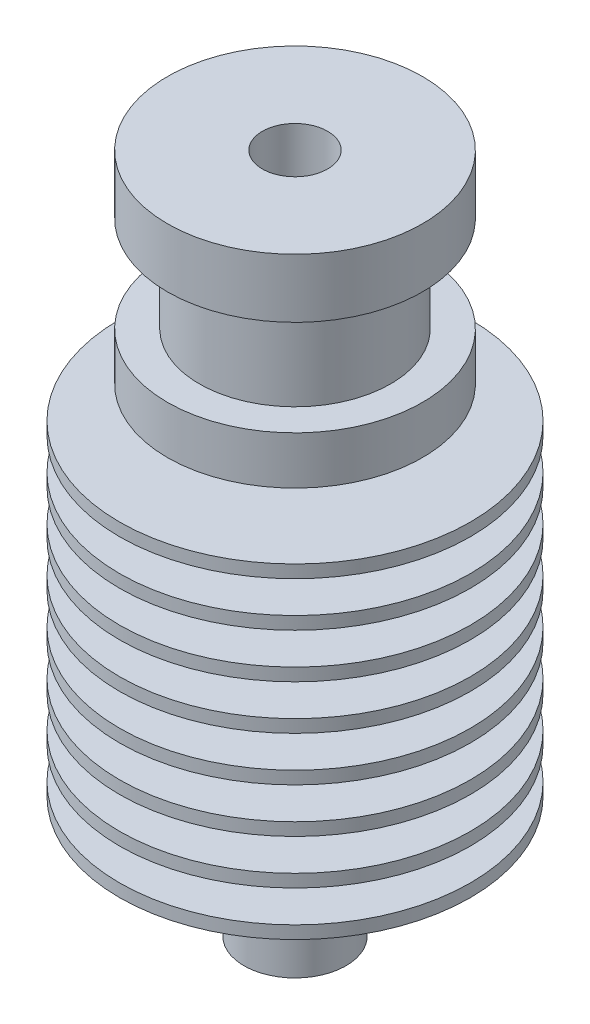
ISO-10303-21;
HEADER;
FILE_DESCRIPTION(('STEP AP214'),'2;1');
FILE_NAME('part.step','',(''),(''),'','','');
FILE_SCHEMA(('AUTOMOTIVE_DESIGN { 1 0 10303 214 1 1 1 1 }'));
ENDSEC;
DATA;
#1=APPLICATION_CONTEXT('core data for automotive mechanical design processes');
#2=APPLICATION_PROTOCOL_DEFINITION('international standard','automotive_design',2000,#1);
#3=PRODUCT_CONTEXT('',#1,'mechanical');
#4=PRODUCT('Part','Part','',(#3));
#5=PRODUCT_RELATED_PRODUCT_CATEGORY('part','',(#4));
#6=PRODUCT_DEFINITION_FORMATION('','',#4);
#7=PRODUCT_DEFINITION_CONTEXT('part definition',#1,'design');
#8=PRODUCT_DEFINITION('design','',#6,#7);
#9=PRODUCT_DEFINITION_SHAPE('','',#8);
#10=(LENGTH_UNIT() NAMED_UNIT(*) SI_UNIT(.MILLI.,.METRE.));
#11=(NAMED_UNIT(*) PLANE_ANGLE_UNIT() SI_UNIT($,.RADIAN.));
#12=(NAMED_UNIT(*) SI_UNIT($,.STERADIAN.) SOLID_ANGLE_UNIT());
#13=UNCERTAINTY_MEASURE_WITH_UNIT(LENGTH_MEASURE(1.E-05),#10,'distance_accuracy_value','');
#14=(GEOMETRIC_REPRESENTATION_CONTEXT(3) GLOBAL_UNCERTAINTY_ASSIGNED_CONTEXT((#13)) GLOBAL_UNIT_ASSIGNED_CONTEXT((#10,
#11,#12)) REPRESENTATION_CONTEXT('',''));
#15=CARTESIAN_POINT('',(0.,0.,0.));
#16=DIRECTION('',(0.,0.,1.));
#17=DIRECTION('',(1.,0.,0.));
#18=AXIS2_PLACEMENT_3D('',#15,#16,#17);
#19=CARTESIAN_POINT('',(6.,11.65,0.));
#20=DIRECTION('',(0.,1.,0.));
#21=DIRECTION('',(0.,0.,1.));
#22=AXIS2_PLACEMENT_3D('',#19,#20,#21);
#23=PLANE('',#22);
#24=CARTESIAN_POINT('',(0.,11.65,0.));
#25=DIRECTION('',(0.,-1.,0.));
#26=DIRECTION('',(0.,0.,-1.));
#27=AXIS2_PLACEMENT_3D('',#24,#25,#26);
#28=CIRCLE('',#27,6.);
#29=CARTESIAN_POINT('',(0.,11.65,-6.));
#30=VERTEX_POINT('',#29);
#31=EDGE_CURVE('E221',#30,#30,#28,.T.);
#32=ORIENTED_EDGE('',*,*,#31,.T.);
#33=EDGE_LOOP('',(#32));
#34=FACE_BOUND('',#33,.T.);
#35=CARTESIAN_POINT('',(0.,11.65,0.));
#36=DIRECTION('',(0.,-1.,0.));
#37=DIRECTION('',(0.,0.,-1.));
#38=AXIS2_PLACEMENT_3D('',#35,#36,#37);
#39=CIRCLE('',#38,7.99999999999999);
#40=CARTESIAN_POINT('',(0.,11.65,-7.99999999999999));
#41=VERTEX_POINT('',#40);
#42=EDGE_CURVE('E10',#41,#41,#39,.T.);
#43=ORIENTED_EDGE('',*,*,#42,.F.);
#44=EDGE_LOOP('',(#43));
#45=FACE_BOUND('',#44,.T.);
#46=ADVANCED_FACE('F40',(#34,#45),#23,.T.);
#47=CARTESIAN_POINT('',(0.,-21.35,0.));
#48=DIRECTION('',(0.,-1.,0.));
#49=DIRECTION('',(0.,0.,-1.));
#50=AXIS2_PLACEMENT_3D('',#47,#48,#49);
#51=CYLINDRICAL_SURFACE('',#50,7.99999999999999);
#52=ORIENTED_EDGE('',*,*,#42,.T.);
#53=EDGE_LOOP('',(#52));
#54=FACE_BOUND('',#53,.T.);
#55=CARTESIAN_POINT('',(0.,8.65,0.));
#56=DIRECTION('',(0.,-1.,0.));
#57=DIRECTION('',(0.,0.,-1.));
#58=AXIS2_PLACEMENT_3D('',#55,#56,#57);
#59=CIRCLE('',#58,7.99999999999999);
#60=CARTESIAN_POINT('',(0.,8.65,-7.99999999999999));
#61=VERTEX_POINT('',#60);
#62=EDGE_CURVE('E47',#61,#61,#59,.T.);
#63=ORIENTED_EDGE('',*,*,#62,.F.);
#64=EDGE_LOOP('',(#63));
#65=FACE_BOUND('',#64,.T.);
#66=ADVANCED_FACE('F239',(#54,#65),#51,.T.);
#67=CARTESIAN_POINT('',(7.99999999999999,8.65,0.));
#68=DIRECTION('',(0.,-1.,0.));
#69=DIRECTION('',(0.,0.,-1.));
#70=AXIS2_PLACEMENT_3D('',#67,#68,#69);
#71=PLANE('',#70);
#72=ORIENTED_EDGE('',*,*,#62,.T.);
#73=EDGE_LOOP('',(#72));
#74=FACE_BOUND('',#73,.T.);
#75=CARTESIAN_POINT('',(0.,8.65000000000001,0.));
#76=DIRECTION('',(0.,-1.,0.));
#77=DIRECTION('',(0.,0.,-1.));
#78=AXIS2_PLACEMENT_3D('',#75,#76,#77);
#79=CIRCLE('',#78,3.);
#80=CARTESIAN_POINT('',(0.,8.65000000000001,-3.));
#81=VERTEX_POINT('',#80);
#82=EDGE_CURVE('E54',#81,#81,#79,.T.);
#83=ORIENTED_EDGE('',*,*,#82,.F.);
#84=EDGE_LOOP('',(#83));
#85=FACE_BOUND('',#84,.T.);
#86=ADVANCED_FACE('F243',(#74,#85),#71,.T.);
#87=CARTESIAN_POINT('',(0.,-21.35,0.));
#88=DIRECTION('',(0.,-1.,0.));
#89=DIRECTION('',(0.,0.,-1.));
#90=AXIS2_PLACEMENT_3D('',#87,#88,#89);
#91=CYLINDRICAL_SURFACE('',#90,3.);
#92=ORIENTED_EDGE('',*,*,#82,.T.);
#93=EDGE_LOOP('',(#92));
#94=FACE_BOUND('',#93,.T.);
#95=CARTESIAN_POINT('',(0.,6.65,0.));
#96=DIRECTION('',(0.,-1.,0.));
#97=DIRECTION('',(0.,0.,-1.));
#98=AXIS2_PLACEMENT_3D('',#95,#96,#97);
#99=CIRCLE('',#98,3.);
#100=CARTESIAN_POINT('',(0.,6.65,-3.));
#101=VERTEX_POINT('',#100);
#102=EDGE_CURVE('E61',#101,#101,#99,.T.);
#103=ORIENTED_EDGE('',*,*,#102,.F.);
#104=EDGE_LOOP('',(#103));
#105=FACE_BOUND('',#104,.T.);
#106=ADVANCED_FACE('F247',(#94,#105),#91,.T.);
#107=CARTESIAN_POINT('',(3.,6.65,0.));
#108=DIRECTION('',(0.,1.,0.));
#109=DIRECTION('',(0.,0.,1.));
#110=AXIS2_PLACEMENT_3D('',#107,#108,#109);
#111=PLANE('',#110);
#112=ORIENTED_EDGE('',*,*,#102,.T.);
#113=EDGE_LOOP('',(#112));
#114=FACE_BOUND('',#113,.T.);
#115=CARTESIAN_POINT('',(0.,6.65,0.));
#116=DIRECTION('',(0.,-1.,0.));
#117=DIRECTION('',(0.,0.,-1.));
#118=AXIS2_PLACEMENT_3D('',#115,#116,#117);
#119=CIRCLE('',#118,11.);
#120=CARTESIAN_POINT('',(0.,6.65,-11.));
#121=VERTEX_POINT('',#120);
#122=EDGE_CURVE('E67',#121,#121,#119,.T.);
#123=ORIENTED_EDGE('',*,*,#122,.F.);
#124=EDGE_LOOP('',(#123));
#125=FACE_BOUND('',#124,.T.);
#126=ADVANCED_FACE('F253',(#114,#125),#111,.T.);
#127=CARTESIAN_POINT('',(0.,-21.35,0.));
#128=DIRECTION('',(0.,-1.,0.));
#129=DIRECTION('',(0.,0.,-1.));
#130=AXIS2_PLACEMENT_3D('',#127,#128,#129);
#131=CYLINDRICAL_SURFACE('',#130,11.);
#132=ORIENTED_EDGE('',*,*,#122,.T.);
#133=EDGE_LOOP('',(#132));
#134=FACE_BOUND('',#133,.T.);
#135=CARTESIAN_POINT('',(0.,5.85,0.));
#136=DIRECTION('',(0.,-1.,0.));
#137=DIRECTION('',(0.,0.,-1.));
#138=AXIS2_PLACEMENT_3D('',#135,#136,#137);
#139=CIRCLE('',#138,11.);
#140=CARTESIAN_POINT('',(0.,5.85,-11.));
#141=VERTEX_POINT('',#140);
#142=EDGE_CURVE('E71',#141,#141,#139,.T.);
#143=ORIENTED_EDGE('',*,*,#142,.F.);
#144=EDGE_LOOP('',(#143));
#145=FACE_BOUND('',#144,.T.);
#146=ADVANCED_FACE('F257',(#134,#145),#131,.T.);
#147=CARTESIAN_POINT('',(11.,5.85,0.));
#148=DIRECTION('',(0.,-1.,0.));
#149=DIRECTION('',(0.,0.,-1.));
#150=AXIS2_PLACEMENT_3D('',#147,#148,#149);
#151=PLANE('',#150);
#152=ORIENTED_EDGE('',*,*,#142,.T.);
#153=EDGE_LOOP('',(#152));
#154=FACE_BOUND('',#153,.T.);
#155=CARTESIAN_POINT('',(0.,5.85,0.));
#156=DIRECTION('',(0.,-1.,0.));
#157=DIRECTION('',(0.,0.,-1.));
#158=AXIS2_PLACEMENT_3D('',#155,#156,#157);
#159=CIRCLE('',#158,3.);
#160=CARTESIAN_POINT('',(0.,5.85,-3.));
#161=VERTEX_POINT('',#160);
#162=EDGE_CURVE('E75',#161,#161,#159,.T.);
#163=ORIENTED_EDGE('',*,*,#162,.F.);
#164=EDGE_LOOP('',(#163));
#165=FACE_BOUND('',#164,.T.);
#166=ADVANCED_FACE('F261',(#154,#165),#151,.T.);
#167=CARTESIAN_POINT('',(0.,-21.35,0.));
#168=DIRECTION('',(0.,-1.,0.));
#169=DIRECTION('',(0.,0.,-1.));
#170=AXIS2_PLACEMENT_3D('',#167,#168,#169);
#171=CYLINDRICAL_SURFACE('',#170,3.);
#172=ORIENTED_EDGE('',*,*,#162,.T.);
#173=EDGE_LOOP('',(#172));
#174=FACE_BOUND('',#173,.T.);
#175=CARTESIAN_POINT('',(0.,3.85,0.));
#176=DIRECTION('',(0.,-1.,0.));
#177=DIRECTION('',(0.,0.,-1.));
#178=AXIS2_PLACEMENT_3D('',#175,#176,#177);
#179=CIRCLE('',#178,3.);
#180=CARTESIAN_POINT('',(0.,3.85,-3.));
#181=VERTEX_POINT('',#180);
#182=EDGE_CURVE('E79',#181,#181,#179,.T.);
#183=ORIENTED_EDGE('',*,*,#182,.F.);
#184=EDGE_LOOP('',(#183));
#185=FACE_BOUND('',#184,.T.);
#186=ADVANCED_FACE('F265',(#174,#185),#171,.T.);
#187=CARTESIAN_POINT('',(3.,3.85,0.));
#188=DIRECTION('',(0.,1.,0.));
#189=DIRECTION('',(0.,0.,1.));
#190=AXIS2_PLACEMENT_3D('',#187,#188,#189);
#191=PLANE('',#190);
#192=ORIENTED_EDGE('',*,*,#182,.T.);
#193=EDGE_LOOP('',(#192));
#194=FACE_BOUND('',#193,.T.);
#195=CARTESIAN_POINT('',(0.,3.85,0.));
#196=DIRECTION('',(0.,-1.,0.));
#197=DIRECTION('',(0.,0.,-1.));
#198=AXIS2_PLACEMENT_3D('',#195,#196,#197);
#199=CIRCLE('',#198,11.);
#200=CARTESIAN_POINT('',(0.,3.85,-11.));
#201=VERTEX_POINT('',#200);
#202=EDGE_CURVE('E83',#201,#201,#199,.T.);
#203=ORIENTED_EDGE('',*,*,#202,.F.);
#204=EDGE_LOOP('',(#203));
#205=FACE_BOUND('',#204,.T.);
#206=ADVANCED_FACE('F269',(#194,#205),#191,.T.);
#207=CARTESIAN_POINT('',(0.,-21.35,0.));
#208=DIRECTION('',(0.,-1.,0.));
#209=DIRECTION('',(0.,0.,-1.));
#210=AXIS2_PLACEMENT_3D('',#207,#208,#209);
#211=CYLINDRICAL_SURFACE('',#210,11.);
#212=ORIENTED_EDGE('',*,*,#202,.T.);
#213=EDGE_LOOP('',(#212));
#214=FACE_BOUND('',#213,.T.);
#215=CARTESIAN_POINT('',(0.,3.05,0.));
#216=DIRECTION('',(0.,-1.,0.));
#217=DIRECTION('',(0.,0.,-1.));
#218=AXIS2_PLACEMENT_3D('',#215,#216,#217);
#219=CIRCLE('',#218,11.);
#220=CARTESIAN_POINT('',(0.,3.05,-11.));
#221=VERTEX_POINT('',#220);
#222=EDGE_CURVE('E87',#221,#221,#219,.T.);
#223=ORIENTED_EDGE('',*,*,#222,.F.);
#224=EDGE_LOOP('',(#223));
#225=FACE_BOUND('',#224,.T.);
#226=ADVANCED_FACE('F273',(#214,#225),#211,.T.);
#227=CARTESIAN_POINT('',(11.,3.05,0.));
#228=DIRECTION('',(0.,-1.,0.));
#229=DIRECTION('',(0.,0.,-1.));
#230=AXIS2_PLACEMENT_3D('',#227,#228,#229);
#231=PLANE('',#230);
#232=ORIENTED_EDGE('',*,*,#222,.T.);
#233=EDGE_LOOP('',(#232));
#234=FACE_BOUND('',#233,.T.);
#235=CARTESIAN_POINT('',(0.,3.05,0.));
#236=DIRECTION('',(0.,-1.,0.));
#237=DIRECTION('',(0.,0.,-1.));
#238=AXIS2_PLACEMENT_3D('',#235,#236,#237);
#239=CIRCLE('',#238,3.);
#240=CARTESIAN_POINT('',(0.,3.05,-3.));
#241=VERTEX_POINT('',#240);
#242=EDGE_CURVE('E91',#241,#241,#239,.T.);
#243=ORIENTED_EDGE('',*,*,#242,.F.);
#244=EDGE_LOOP('',(#243));
#245=FACE_BOUND('',#244,.T.);
#246=ADVANCED_FACE('F277',(#234,#245),#231,.T.);
#247=CARTESIAN_POINT('',(0.,-21.35,0.));
#248=DIRECTION('',(0.,-1.,0.));
#249=DIRECTION('',(0.,0.,-1.));
#250=AXIS2_PLACEMENT_3D('',#247,#248,#249);
#251=CYLINDRICAL_SURFACE('',#250,3.);
#252=ORIENTED_EDGE('',*,*,#242,.T.);
#253=EDGE_LOOP('',(#252));
#254=FACE_BOUND('',#253,.T.);
#255=CARTESIAN_POINT('',(0.,1.05,0.));
#256=DIRECTION('',(0.,-1.,0.));
#257=DIRECTION('',(0.,0.,-1.));
#258=AXIS2_PLACEMENT_3D('',#255,#256,#257);
#259=CIRCLE('',#258,3.);
#260=CARTESIAN_POINT('',(0.,1.05,-3.));
#261=VERTEX_POINT('',#260);
#262=EDGE_CURVE('E95',#261,#261,#259,.T.);
#263=ORIENTED_EDGE('',*,*,#262,.F.);
#264=EDGE_LOOP('',(#263));
#265=FACE_BOUND('',#264,.T.);
#266=ADVANCED_FACE('F281',(#254,#265),#251,.T.);
#267=CARTESIAN_POINT('',(3.,1.05,0.));
#268=DIRECTION('',(0.,1.,0.));
#269=DIRECTION('',(0.,0.,1.));
#270=AXIS2_PLACEMENT_3D('',#267,#268,#269);
#271=PLANE('',#270);
#272=ORIENTED_EDGE('',*,*,#262,.T.);
#273=EDGE_LOOP('',(#272));
#274=FACE_BOUND('',#273,.T.);
#275=CARTESIAN_POINT('',(0.,1.05,0.));
#276=DIRECTION('',(0.,-1.,0.));
#277=DIRECTION('',(0.,0.,-1.));
#278=AXIS2_PLACEMENT_3D('',#275,#276,#277);
#279=CIRCLE('',#278,11.);
#280=CARTESIAN_POINT('',(0.,1.05,-11.));
#281=VERTEX_POINT('',#280);
#282=EDGE_CURVE('E99',#281,#281,#279,.T.);
#283=ORIENTED_EDGE('',*,*,#282,.F.);
#284=EDGE_LOOP('',(#283));
#285=FACE_BOUND('',#284,.T.);
#286=ADVANCED_FACE('F285',(#274,#285),#271,.T.);
#287=CARTESIAN_POINT('',(0.,-21.35,0.));
#288=DIRECTION('',(0.,-1.,0.));
#289=DIRECTION('',(0.,0.,-1.));
#290=AXIS2_PLACEMENT_3D('',#287,#288,#289);
#291=CYLINDRICAL_SURFACE('',#290,11.);
#292=ORIENTED_EDGE('',*,*,#282,.T.);
#293=EDGE_LOOP('',(#292));
#294=FACE_BOUND('',#293,.T.);
#295=CARTESIAN_POINT('',(0.,0.25,0.));
#296=DIRECTION('',(0.,-1.,0.));
#297=DIRECTION('',(0.,0.,-1.));
#298=AXIS2_PLACEMENT_3D('',#295,#296,#297);
#299=CIRCLE('',#298,11.);
#300=CARTESIAN_POINT('',(0.,0.25,-11.));
#301=VERTEX_POINT('',#300);
#302=EDGE_CURVE('E103',#301,#301,#299,.T.);
#303=ORIENTED_EDGE('',*,*,#302,.F.);
#304=EDGE_LOOP('',(#303));
#305=FACE_BOUND('',#304,.T.);
#306=ADVANCED_FACE('F289',(#294,#305),#291,.T.);
#307=CARTESIAN_POINT('',(11.,0.249999999999998,0.));
#308=DIRECTION('',(0.,-1.,0.));
#309=DIRECTION('',(0.,0.,-1.));
#310=AXIS2_PLACEMENT_3D('',#307,#308,#309);
#311=PLANE('',#310);
#312=ORIENTED_EDGE('',*,*,#302,.T.);
#313=EDGE_LOOP('',(#312));
#314=FACE_BOUND('',#313,.T.);
#315=CARTESIAN_POINT('',(0.,0.249999999999997,0.));
#316=DIRECTION('',(0.,-1.,0.));
#317=DIRECTION('',(0.,0.,-1.));
#318=AXIS2_PLACEMENT_3D('',#315,#316,#317);
#319=CIRCLE('',#318,3.);
#320=CARTESIAN_POINT('',(0.,0.249999999999997,-3.));
#321=VERTEX_POINT('',#320);
#322=EDGE_CURVE('E107',#321,#321,#319,.T.);
#323=ORIENTED_EDGE('',*,*,#322,.F.);
#324=EDGE_LOOP('',(#323));
#325=FACE_BOUND('',#324,.T.);
#326=ADVANCED_FACE('F293',(#314,#325),#311,.T.);
#327=CARTESIAN_POINT('',(0.,-21.35,0.));
#328=DIRECTION('',(0.,-1.,0.));
#329=DIRECTION('',(0.,0.,-1.));
#330=AXIS2_PLACEMENT_3D('',#327,#328,#329);
#331=CYLINDRICAL_SURFACE('',#330,3.);
#332=ORIENTED_EDGE('',*,*,#322,.T.);
#333=EDGE_LOOP('',(#332));
#334=FACE_BOUND('',#333,.T.);
#335=CARTESIAN_POINT('',(0.,-1.75,0.));
#336=DIRECTION('',(0.,-1.,0.));
#337=DIRECTION('',(0.,0.,-1.));
#338=AXIS2_PLACEMENT_3D('',#335,#336,#337);
#339=CIRCLE('',#338,3.);
#340=CARTESIAN_POINT('',(0.,-1.75,-3.));
#341=VERTEX_POINT('',#340);
#342=EDGE_CURVE('E111',#341,#341,#339,.T.);
#343=ORIENTED_EDGE('',*,*,#342,.F.);
#344=EDGE_LOOP('',(#343));
#345=FACE_BOUND('',#344,.T.);
#346=ADVANCED_FACE('F297',(#334,#345),#331,.T.);
#347=CARTESIAN_POINT('',(3.,-1.75,0.));
#348=DIRECTION('',(0.,1.,0.));
#349=DIRECTION('',(0.,0.,1.));
#350=AXIS2_PLACEMENT_3D('',#347,#348,#349);
#351=PLANE('',#350);
#352=ORIENTED_EDGE('',*,*,#342,.T.);
#353=EDGE_LOOP('',(#352));
#354=FACE_BOUND('',#353,.T.);
#355=CARTESIAN_POINT('',(0.,-1.75,0.));
#356=DIRECTION('',(0.,-1.,0.));
#357=DIRECTION('',(0.,0.,-1.));
#358=AXIS2_PLACEMENT_3D('',#355,#356,#357);
#359=CIRCLE('',#358,11.);
#360=CARTESIAN_POINT('',(0.,-1.75,-11.));
#361=VERTEX_POINT('',#360);
#362=EDGE_CURVE('E115',#361,#361,#359,.T.);
#363=ORIENTED_EDGE('',*,*,#362,.F.);
#364=EDGE_LOOP('',(#363));
#365=FACE_BOUND('',#364,.T.);
#366=ADVANCED_FACE('F301',(#354,#365),#351,.T.);
#367=CARTESIAN_POINT('',(0.,-21.35,0.));
#368=DIRECTION('',(0.,-1.,0.));
#369=DIRECTION('',(0.,0.,-1.));
#370=AXIS2_PLACEMENT_3D('',#367,#368,#369);
#371=CYLINDRICAL_SURFACE('',#370,11.);
#372=ORIENTED_EDGE('',*,*,#362,.T.);
#373=EDGE_LOOP('',(#372));
#374=FACE_BOUND('',#373,.T.);
#375=CARTESIAN_POINT('',(0.,-2.55,0.));
#376=DIRECTION('',(0.,-1.,0.));
#377=DIRECTION('',(0.,0.,-1.));
#378=AXIS2_PLACEMENT_3D('',#375,#376,#377);
#379=CIRCLE('',#378,11.);
#380=CARTESIAN_POINT('',(0.,-2.55,-11.));
#381=VERTEX_POINT('',#380);
#382=EDGE_CURVE('E119',#381,#381,#379,.T.);
#383=ORIENTED_EDGE('',*,*,#382,.F.);
#384=EDGE_LOOP('',(#383));
#385=FACE_BOUND('',#384,.T.);
#386=ADVANCED_FACE('F305',(#374,#385),#371,.T.);
#387=CARTESIAN_POINT('',(11.,-2.55,0.));
#388=DIRECTION('',(0.,-1.,0.));
#389=DIRECTION('',(0.,0.,-1.));
#390=AXIS2_PLACEMENT_3D('',#387,#388,#389);
#391=PLANE('',#390);
#392=ORIENTED_EDGE('',*,*,#382,.T.);
#393=EDGE_LOOP('',(#392));
#394=FACE_BOUND('',#393,.T.);
#395=CARTESIAN_POINT('',(0.,-2.55,0.));
#396=DIRECTION('',(0.,-1.,0.));
#397=DIRECTION('',(0.,0.,-1.));
#398=AXIS2_PLACEMENT_3D('',#395,#396,#397);
#399=CIRCLE('',#398,3.);
#400=CARTESIAN_POINT('',(0.,-2.55,-3.));
#401=VERTEX_POINT('',#400);
#402=EDGE_CURVE('E123',#401,#401,#399,.T.);
#403=ORIENTED_EDGE('',*,*,#402,.F.);
#404=EDGE_LOOP('',(#403));
#405=FACE_BOUND('',#404,.T.);
#406=ADVANCED_FACE('F309',(#394,#405),#391,.T.);
#407=CARTESIAN_POINT('',(0.,-21.35,0.));
#408=DIRECTION('',(0.,-1.,0.));
#409=DIRECTION('',(0.,0.,-1.));
#410=AXIS2_PLACEMENT_3D('',#407,#408,#409);
#411=CYLINDRICAL_SURFACE('',#410,3.);
#412=ORIENTED_EDGE('',*,*,#402,.T.);
#413=EDGE_LOOP('',(#412));
#414=FACE_BOUND('',#413,.T.);
#415=CARTESIAN_POINT('',(0.,-4.55000000000001,0.));
#416=DIRECTION('',(0.,-1.,0.));
#417=DIRECTION('',(0.,0.,-1.));
#418=AXIS2_PLACEMENT_3D('',#415,#416,#417);
#419=CIRCLE('',#418,3.);
#420=CARTESIAN_POINT('',(0.,-4.55000000000001,-3.));
#421=VERTEX_POINT('',#420);
#422=EDGE_CURVE('E127',#421,#421,#419,.T.);
#423=ORIENTED_EDGE('',*,*,#422,.F.);
#424=EDGE_LOOP('',(#423));
#425=FACE_BOUND('',#424,.T.);
#426=ADVANCED_FACE('F313',(#414,#425),#411,.T.);
#427=CARTESIAN_POINT('',(3.,-4.55,0.));
#428=DIRECTION('',(0.,1.,0.));
#429=DIRECTION('',(0.,0.,1.));
#430=AXIS2_PLACEMENT_3D('',#427,#428,#429);
#431=PLANE('',#430);
#432=ORIENTED_EDGE('',*,*,#422,.T.);
#433=EDGE_LOOP('',(#432));
#434=FACE_BOUND('',#433,.T.);
#435=CARTESIAN_POINT('',(0.,-4.55000000000001,0.));
#436=DIRECTION('',(0.,-1.,0.));
#437=DIRECTION('',(0.,0.,-1.));
#438=AXIS2_PLACEMENT_3D('',#435,#436,#437);
#439=CIRCLE('',#438,11.);
#440=CARTESIAN_POINT('',(0.,-4.55000000000001,-11.));
#441=VERTEX_POINT('',#440);
#442=EDGE_CURVE('E131',#441,#441,#439,.T.);
#443=ORIENTED_EDGE('',*,*,#442,.F.);
#444=EDGE_LOOP('',(#443));
#445=FACE_BOUND('',#444,.T.);
#446=ADVANCED_FACE('F317',(#434,#445),#431,.T.);
#447=CARTESIAN_POINT('',(0.,-21.35,0.));
#448=DIRECTION('',(0.,-1.,0.));
#449=DIRECTION('',(0.,0.,-1.));
#450=AXIS2_PLACEMENT_3D('',#447,#448,#449);
#451=CYLINDRICAL_SURFACE('',#450,11.);
#452=ORIENTED_EDGE('',*,*,#442,.T.);
#453=EDGE_LOOP('',(#452));
#454=FACE_BOUND('',#453,.T.);
#455=CARTESIAN_POINT('',(0.,-5.35,0.));
#456=DIRECTION('',(0.,-1.,0.));
#457=DIRECTION('',(0.,0.,-1.));
#458=AXIS2_PLACEMENT_3D('',#455,#456,#457);
#459=CIRCLE('',#458,11.);
#460=CARTESIAN_POINT('',(0.,-5.35,-11.));
#461=VERTEX_POINT('',#460);
#462=EDGE_CURVE('E135',#461,#461,#459,.T.);
#463=ORIENTED_EDGE('',*,*,#462,.F.);
#464=EDGE_LOOP('',(#463));
#465=FACE_BOUND('',#464,.T.);
#466=ADVANCED_FACE('F321',(#454,#465),#451,.T.);
#467=CARTESIAN_POINT('',(11.,-5.35000000000001,0.));
#468=DIRECTION('',(0.,-1.,0.));
#469=DIRECTION('',(0.,0.,-1.));
#470=AXIS2_PLACEMENT_3D('',#467,#468,#469);
#471=PLANE('',#470);
#472=ORIENTED_EDGE('',*,*,#462,.T.);
#473=EDGE_LOOP('',(#472));
#474=FACE_BOUND('',#473,.T.);
#475=CARTESIAN_POINT('',(0.,-5.35000000000001,0.));
#476=DIRECTION('',(0.,-1.,0.));
#477=DIRECTION('',(0.,0.,-1.));
#478=AXIS2_PLACEMENT_3D('',#475,#476,#477);
#479=CIRCLE('',#478,3.);
#480=CARTESIAN_POINT('',(0.,-5.35000000000001,-3.));
#481=VERTEX_POINT('',#480);
#482=EDGE_CURVE('E139',#481,#481,#479,.T.);
#483=ORIENTED_EDGE('',*,*,#482,.F.);
#484=EDGE_LOOP('',(#483));
#485=FACE_BOUND('',#484,.T.);
#486=ADVANCED_FACE('F325',(#474,#485),#471,.T.);
#487=CARTESIAN_POINT('',(0.,-21.35,0.));
#488=DIRECTION('',(0.,-1.,0.));
#489=DIRECTION('',(0.,0.,-1.));
#490=AXIS2_PLACEMENT_3D('',#487,#488,#489);
#491=CYLINDRICAL_SURFACE('',#490,3.);
#492=ORIENTED_EDGE('',*,*,#482,.T.);
#493=EDGE_LOOP('',(#492));
#494=FACE_BOUND('',#493,.T.);
#495=CARTESIAN_POINT('',(0.,-7.35000000000001,0.));
#496=DIRECTION('',(0.,-1.,0.));
#497=DIRECTION('',(0.,0.,-1.));
#498=AXIS2_PLACEMENT_3D('',#495,#496,#497);
#499=CIRCLE('',#498,3.);
#500=CARTESIAN_POINT('',(0.,-7.35000000000001,-3.));
#501=VERTEX_POINT('',#500);
#502=EDGE_CURVE('E143',#501,#501,#499,.T.);
#503=ORIENTED_EDGE('',*,*,#502,.F.);
#504=EDGE_LOOP('',(#503));
#505=FACE_BOUND('',#504,.T.);
#506=ADVANCED_FACE('F329',(#494,#505),#491,.T.);
#507=CARTESIAN_POINT('',(3.,-7.35000000000001,0.));
#508=DIRECTION('',(0.,1.,0.));
#509=DIRECTION('',(0.,0.,1.));
#510=AXIS2_PLACEMENT_3D('',#507,#508,#509);
#511=PLANE('',#510);
#512=ORIENTED_EDGE('',*,*,#502,.T.);
#513=EDGE_LOOP('',(#512));
#514=FACE_BOUND('',#513,.T.);
#515=CARTESIAN_POINT('',(0.,-7.35000000000001,0.));
#516=DIRECTION('',(0.,-1.,0.));
#517=DIRECTION('',(0.,0.,-1.));
#518=AXIS2_PLACEMENT_3D('',#515,#516,#517);
#519=CIRCLE('',#518,11.);
#520=CARTESIAN_POINT('',(0.,-7.35000000000001,-11.));
#521=VERTEX_POINT('',#520);
#522=EDGE_CURVE('E147',#521,#521,#519,.T.);
#523=ORIENTED_EDGE('',*,*,#522,.F.);
#524=EDGE_LOOP('',(#523));
#525=FACE_BOUND('',#524,.T.);
#526=ADVANCED_FACE('F333',(#514,#525),#511,.T.);
#527=CARTESIAN_POINT('',(0.,-21.35,0.));
#528=DIRECTION('',(0.,-1.,0.));
#529=DIRECTION('',(0.,0.,-1.));
#530=AXIS2_PLACEMENT_3D('',#527,#528,#529);
#531=CYLINDRICAL_SURFACE('',#530,11.);
#532=ORIENTED_EDGE('',*,*,#522,.T.);
#533=EDGE_LOOP('',(#532));
#534=FACE_BOUND('',#533,.T.);
#535=CARTESIAN_POINT('',(0.,-8.15000000000001,0.));
#536=DIRECTION('',(0.,-1.,0.));
#537=DIRECTION('',(0.,0.,-1.));
#538=AXIS2_PLACEMENT_3D('',#535,#536,#537);
#539=CIRCLE('',#538,11.);
#540=CARTESIAN_POINT('',(0.,-8.15000000000001,-11.));
#541=VERTEX_POINT('',#540);
#542=EDGE_CURVE('E151',#541,#541,#539,.T.);
#543=ORIENTED_EDGE('',*,*,#542,.F.);
#544=EDGE_LOOP('',(#543));
#545=FACE_BOUND('',#544,.T.);
#546=ADVANCED_FACE('F337',(#534,#545),#531,.T.);
#547=CARTESIAN_POINT('',(11.,-8.15000000000001,0.));
#548=DIRECTION('',(0.,-1.,0.));
#549=DIRECTION('',(0.,0.,-1.));
#550=AXIS2_PLACEMENT_3D('',#547,#548,#549);
#551=PLANE('',#550);
#552=ORIENTED_EDGE('',*,*,#542,.T.);
#553=EDGE_LOOP('',(#552));
#554=FACE_BOUND('',#553,.T.);
#555=CARTESIAN_POINT('',(0.,-8.15000000000001,0.));
#556=DIRECTION('',(0.,-1.,0.));
#557=DIRECTION('',(0.,0.,-1.));
#558=AXIS2_PLACEMENT_3D('',#555,#556,#557);
#559=CIRCLE('',#558,3.);
#560=CARTESIAN_POINT('',(0.,-8.15000000000001,-3.));
#561=VERTEX_POINT('',#560);
#562=EDGE_CURVE('E154',#561,#561,#559,.T.);
#563=ORIENTED_EDGE('',*,*,#562,.F.);
#564=EDGE_LOOP('',(#563));
#565=FACE_BOUND('',#564,.T.);
#566=ADVANCED_FACE('F341',(#554,#565),#551,.T.);
#567=CARTESIAN_POINT('',(0.,-21.35,0.));
#568=DIRECTION('',(0.,-1.,0.));
#569=DIRECTION('',(0.,0.,-1.));
#570=AXIS2_PLACEMENT_3D('',#567,#568,#569);
#571=CYLINDRICAL_SURFACE('',#570,3.);
#572=ORIENTED_EDGE('',*,*,#562,.T.);
#573=EDGE_LOOP('',(#572));
#574=FACE_BOUND('',#573,.T.);
#575=CARTESIAN_POINT('',(0.,-10.15,0.));
#576=DIRECTION('',(0.,-1.,0.));
#577=DIRECTION('',(0.,0.,-1.));
#578=AXIS2_PLACEMENT_3D('',#575,#576,#577);
#579=CIRCLE('',#578,3.);
#580=CARTESIAN_POINT('',(0.,-10.15,-3.));
#581=VERTEX_POINT('',#580);
#582=EDGE_CURVE('E158',#581,#581,#579,.T.);
#583=ORIENTED_EDGE('',*,*,#582,.F.);
#584=EDGE_LOOP('',(#583));
#585=FACE_BOUND('',#584,.T.);
#586=ADVANCED_FACE('F345',(#574,#585),#571,.T.);
#587=CARTESIAN_POINT('',(3.,-10.15,0.));
#588=DIRECTION('',(0.,1.,0.));
#589=DIRECTION('',(0.,0.,1.));
#590=AXIS2_PLACEMENT_3D('',#587,#588,#589);
#591=PLANE('',#590);
#592=ORIENTED_EDGE('',*,*,#582,.T.);
#593=EDGE_LOOP('',(#592));
#594=FACE_BOUND('',#593,.T.);
#595=CARTESIAN_POINT('',(0.,-10.15,0.));
#596=DIRECTION('',(0.,-1.,0.));
#597=DIRECTION('',(0.,0.,-1.));
#598=AXIS2_PLACEMENT_3D('',#595,#596,#597);
#599=CIRCLE('',#598,11.);
#600=CARTESIAN_POINT('',(0.,-10.15,-11.));
#601=VERTEX_POINT('',#600);
#602=EDGE_CURVE('E162',#601,#601,#599,.T.);
#603=ORIENTED_EDGE('',*,*,#602,.F.);
#604=EDGE_LOOP('',(#603));
#605=FACE_BOUND('',#604,.T.);
#606=ADVANCED_FACE('F349',(#594,#605),#591,.T.);
#607=CARTESIAN_POINT('',(0.,-21.35,0.));
#608=DIRECTION('',(0.,-1.,0.));
#609=DIRECTION('',(0.,0.,-1.));
#610=AXIS2_PLACEMENT_3D('',#607,#608,#609);
#611=CYLINDRICAL_SURFACE('',#610,11.);
#612=ORIENTED_EDGE('',*,*,#602,.T.);
#613=EDGE_LOOP('',(#612));
#614=FACE_BOUND('',#613,.T.);
#615=CARTESIAN_POINT('',(0.,-10.95,0.));
#616=DIRECTION('',(0.,-1.,0.));
#617=DIRECTION('',(0.,0.,-1.));
#618=AXIS2_PLACEMENT_3D('',#615,#616,#617);
#619=CIRCLE('',#618,11.);
#620=CARTESIAN_POINT('',(0.,-10.95,-11.));
#621=VERTEX_POINT('',#620);
#622=EDGE_CURVE('E166',#621,#621,#619,.T.);
#623=ORIENTED_EDGE('',*,*,#622,.F.);
#624=EDGE_LOOP('',(#623));
#625=FACE_BOUND('',#624,.T.);
#626=ADVANCED_FACE('F353',(#614,#625),#611,.T.);
#627=CARTESIAN_POINT('',(11.,-10.95,0.));
#628=DIRECTION('',(0.,-1.,0.));
#629=DIRECTION('',(0.,0.,-1.));
#630=AXIS2_PLACEMENT_3D('',#627,#628,#629);
#631=PLANE('',#630);
#632=ORIENTED_EDGE('',*,*,#622,.T.);
#633=EDGE_LOOP('',(#632));
#634=FACE_BOUND('',#633,.T.);
#635=CARTESIAN_POINT('',(0.,-10.95,0.));
#636=DIRECTION('',(0.,-1.,0.));
#637=DIRECTION('',(0.,0.,-1.));
#638=AXIS2_PLACEMENT_3D('',#635,#636,#637);
#639=CIRCLE('',#638,3.);
#640=CARTESIAN_POINT('',(0.,-10.95,-3.));
#641=VERTEX_POINT('',#640);
#642=EDGE_CURVE('E170',#641,#641,#639,.T.);
#643=ORIENTED_EDGE('',*,*,#642,.F.);
#644=EDGE_LOOP('',(#643));
#645=FACE_BOUND('',#644,.T.);
#646=ADVANCED_FACE('F357',(#634,#645),#631,.T.);
#647=CARTESIAN_POINT('',(0.,-21.35,0.));
#648=DIRECTION('',(0.,-1.,0.));
#649=DIRECTION('',(0.,0.,-1.));
#650=AXIS2_PLACEMENT_3D('',#647,#648,#649);
#651=CYLINDRICAL_SURFACE('',#650,3.);
#652=ORIENTED_EDGE('',*,*,#642,.T.);
#653=EDGE_LOOP('',(#652));
#654=FACE_BOUND('',#653,.T.);
#655=CARTESIAN_POINT('',(0.,-12.95,0.));
#656=DIRECTION('',(0.,-1.,0.));
#657=DIRECTION('',(0.,0.,-1.));
#658=AXIS2_PLACEMENT_3D('',#655,#656,#657);
#659=CIRCLE('',#658,3.);
#660=CARTESIAN_POINT('',(0.,-12.95,-3.));
#661=VERTEX_POINT('',#660);
#662=EDGE_CURVE('E174',#661,#661,#659,.T.);
#663=ORIENTED_EDGE('',*,*,#662,.F.);
#664=EDGE_LOOP('',(#663));
#665=FACE_BOUND('',#664,.T.);
#666=ADVANCED_FACE('F361',(#654,#665),#651,.T.);
#667=CARTESIAN_POINT('',(3.,-12.95,0.));
#668=DIRECTION('',(0.,1.,0.));
#669=DIRECTION('',(0.,0.,1.));
#670=AXIS2_PLACEMENT_3D('',#667,#668,#669);
#671=PLANE('',#670);
#672=ORIENTED_EDGE('',*,*,#662,.T.);
#673=EDGE_LOOP('',(#672));
#674=FACE_BOUND('',#673,.T.);
#675=CARTESIAN_POINT('',(0.,-12.95,0.));
#676=DIRECTION('',(0.,-1.,0.));
#677=DIRECTION('',(0.,0.,-1.));
#678=AXIS2_PLACEMENT_3D('',#675,#676,#677);
#679=CIRCLE('',#678,11.);
#680=CARTESIAN_POINT('',(0.,-12.95,-11.));
#681=VERTEX_POINT('',#680);
#682=EDGE_CURVE('E178',#681,#681,#679,.T.);
#683=ORIENTED_EDGE('',*,*,#682,.F.);
#684=EDGE_LOOP('',(#683));
#685=FACE_BOUND('',#684,.T.);
#686=ADVANCED_FACE('F365',(#674,#685),#671,.T.);
#687=CARTESIAN_POINT('',(0.,-21.35,0.));
#688=DIRECTION('',(0.,-1.,0.));
#689=DIRECTION('',(0.,0.,-1.));
#690=AXIS2_PLACEMENT_3D('',#687,#688,#689);
#691=CYLINDRICAL_SURFACE('',#690,11.);
#692=ORIENTED_EDGE('',*,*,#682,.T.);
#693=EDGE_LOOP('',(#692));
#694=FACE_BOUND('',#693,.T.);
#695=CARTESIAN_POINT('',(0.,-13.75,0.));
#696=DIRECTION('',(0.,-1.,0.));
#697=DIRECTION('',(0.,0.,-1.));
#698=AXIS2_PLACEMENT_3D('',#695,#696,#697);
#699=CIRCLE('',#698,11.);
#700=CARTESIAN_POINT('',(0.,-13.75,-11.));
#701=VERTEX_POINT('',#700);
#702=EDGE_CURVE('E182',#701,#701,#699,.T.);
#703=ORIENTED_EDGE('',*,*,#702,.F.);
#704=EDGE_LOOP('',(#703));
#705=FACE_BOUND('',#704,.T.);
#706=ADVANCED_FACE('F369',(#694,#705),#691,.T.);
#707=CARTESIAN_POINT('',(2.81308008040215,-13.75,0.));
#708=DIRECTION('',(0.,-1.,0.));
#709=DIRECTION('',(0.,0.,-1.));
#710=AXIS2_PLACEMENT_3D('',#707,#708,#709);
#711=PLANE('',#710);
#712=ORIENTED_EDGE('',*,*,#702,.T.);
#713=EDGE_LOOP('',(#712));
#714=FACE_BOUND('',#713,.T.);
#715=CARTESIAN_POINT('',(0.,-13.75,0.));
#716=DIRECTION('',(0.,-1.,0.));
#717=DIRECTION('',(0.,0.,-1.));
#718=AXIS2_PLACEMENT_3D('',#715,#716,#717);
#719=CIRCLE('',#718,2.81308008040215);
#720=CARTESIAN_POINT('',(0.,-13.75,-2.81308008040215));
#721=VERTEX_POINT('',#720);
#722=EDGE_CURVE('E186',#721,#721,#719,.T.);
#723=ORIENTED_EDGE('',*,*,#722,.F.);
#724=EDGE_LOOP('',(#723));
#725=FACE_BOUND('',#724,.T.);
#726=ADVANCED_FACE('F373',(#714,#725),#711,.T.);
#727=CARTESIAN_POINT('',(0.,-21.35,0.));
#728=DIRECTION('',(0.,-1.,0.));
#729=DIRECTION('',(0.,0.,-1.));
#730=AXIS2_PLACEMENT_3D('',#727,#728,#729);
#731=CYLINDRICAL_SURFACE('',#730,2.81308008040215);
#732=ORIENTED_EDGE('',*,*,#722,.T.);
#733=EDGE_LOOP('',(#732));
#734=FACE_BOUND('',#733,.T.);
#735=CARTESIAN_POINT('',(0.,-16.35,0.));
#736=DIRECTION('',(0.,-1.,0.));
#737=DIRECTION('',(0.,0.,-1.));
#738=AXIS2_PLACEMENT_3D('',#735,#736,#737);
#739=CIRCLE('',#738,2.81308008040215);
#740=CARTESIAN_POINT('',(0.,-16.35,-2.81308008040215));
#741=VERTEX_POINT('',#740);
#742=EDGE_CURVE('E190',#741,#741,#739,.T.);
#743=ORIENTED_EDGE('',*,*,#742,.F.);
#744=EDGE_LOOP('',(#743));
#745=FACE_BOUND('',#744,.T.);
#746=ADVANCED_FACE('F377',(#734,#745),#731,.T.);
#747=CARTESIAN_POINT('',(3.2,-16.35,0.));
#748=DIRECTION('',(0.,1.,0.));
#749=DIRECTION('',(0.,0.,1.));
#750=AXIS2_PLACEMENT_3D('',#747,#748,#749);
#751=PLANE('',#750);
#752=ORIENTED_EDGE('',*,*,#742,.T.);
#753=EDGE_LOOP('',(#752));
#754=FACE_BOUND('',#753,.T.);
#755=CARTESIAN_POINT('',(0.,-16.35,0.));
#756=DIRECTION('',(0.,-1.,0.));
#757=DIRECTION('',(0.,0.,-1.));
#758=AXIS2_PLACEMENT_3D('',#755,#756,#757);
#759=CIRCLE('',#758,3.2);
#760=CARTESIAN_POINT('',(0.,-16.35,-3.2));
#761=VERTEX_POINT('',#760);
#762=EDGE_CURVE('E193',#761,#761,#759,.T.);
#763=ORIENTED_EDGE('',*,*,#762,.F.);
#764=EDGE_LOOP('',(#763));
#765=FACE_BOUND('',#764,.T.);
#766=ADVANCED_FACE('F381',(#754,#765),#751,.T.);
#767=CARTESIAN_POINT('',(0.,-21.35,0.));
#768=DIRECTION('',(0.,-1.,0.));
#769=DIRECTION('',(0.,0.,-1.));
#770=AXIS2_PLACEMENT_3D('',#767,#768,#769);
#771=CYLINDRICAL_SURFACE('',#770,3.2);
#772=ORIENTED_EDGE('',*,*,#762,.T.);
#773=EDGE_LOOP('',(#772));
#774=FACE_BOUND('',#773,.T.);
#775=CARTESIAN_POINT('',(0.,-21.35,0.));
#776=DIRECTION('',(0.,-1.,0.));
#777=DIRECTION('',(0.,0.,-1.));
#778=AXIS2_PLACEMENT_3D('',#775,#776,#777);
#779=CIRCLE('',#778,3.2);
#780=CARTESIAN_POINT('',(0.,-21.35,-3.2));
#781=VERTEX_POINT('',#780);
#782=EDGE_CURVE('E197',#781,#781,#779,.T.);
#783=ORIENTED_EDGE('',*,*,#782,.F.);
#784=EDGE_LOOP('',(#783));
#785=FACE_BOUND('',#784,.T.);
#786=ADVANCED_FACE('F385',(#774,#785),#771,.T.);
#787=CARTESIAN_POINT('',(2.05000000000001,-21.35,0.));
#788=DIRECTION('',(0.,-1.,0.));
#789=DIRECTION('',(0.,0.,-1.));
#790=AXIS2_PLACEMENT_3D('',#787,#788,#789);
#791=PLANE('',#790);
#792=ORIENTED_EDGE('',*,*,#782,.T.);
#793=EDGE_LOOP('',(#792));
#794=FACE_BOUND('',#793,.T.);
#795=CARTESIAN_POINT('',(0.,-21.35,0.));
#796=DIRECTION('',(0.,-1.,0.));
#797=DIRECTION('',(0.,0.,-1.));
#798=AXIS2_PLACEMENT_3D('',#795,#796,#797);
#799=CIRCLE('',#798,2.05000000000001);
#800=CARTESIAN_POINT('',(0.,-21.35,-2.05000000000001));
#801=VERTEX_POINT('',#800);
#802=EDGE_CURVE('E201',#801,#801,#799,.T.);
#803=ORIENTED_EDGE('',*,*,#802,.F.);
#804=EDGE_LOOP('',(#803));
#805=FACE_BOUND('',#804,.T.);
#806=ADVANCED_FACE('F389',(#794,#805),#791,.T.);
#807=CARTESIAN_POINT('',(0.,-21.35,0.));
#808=DIRECTION('',(0.,-1.,0.));
#809=DIRECTION('',(0.,0.,-1.));
#810=AXIS2_PLACEMENT_3D('',#807,#808,#809);
#811=CYLINDRICAL_SURFACE('',#810,2.05000000000001);
#812=ORIENTED_EDGE('',*,*,#802,.T.);
#813=EDGE_LOOP('',(#812));
#814=FACE_BOUND('',#813,.T.);
#815=CARTESIAN_POINT('',(0.,21.35,0.));
#816=DIRECTION('',(0.,-1.,0.));
#817=DIRECTION('',(0.,0.,-1.));
#818=AXIS2_PLACEMENT_3D('',#815,#816,#817);
#819=CIRCLE('',#818,2.05000000000001);
#820=CARTESIAN_POINT('',(0.,21.35,-2.05000000000001));
#821=VERTEX_POINT('',#820);
#822=EDGE_CURVE('E205',#821,#821,#819,.T.);
#823=ORIENTED_EDGE('',*,*,#822,.F.);
#824=EDGE_LOOP('',(#823));
#825=FACE_BOUND('',#824,.T.);
#826=ADVANCED_FACE('F393',(#814,#825),#811,.F.);
#827=CARTESIAN_POINT('',(2.05000000000001,21.35,0.));
#828=DIRECTION('',(0.,1.,0.));
#829=DIRECTION('',(0.,0.,1.));
#830=AXIS2_PLACEMENT_3D('',#827,#828,#829);
#831=PLANE('',#830);
#832=ORIENTED_EDGE('',*,*,#822,.T.);
#833=EDGE_LOOP('',(#832));
#834=FACE_BOUND('',#833,.T.);
#835=CARTESIAN_POINT('',(0.,21.35,0.));
#836=DIRECTION('',(0.,-1.,0.));
#837=DIRECTION('',(0.,0.,-1.));
#838=AXIS2_PLACEMENT_3D('',#835,#836,#837);
#839=CIRCLE('',#838,7.99999999999999);
#840=CARTESIAN_POINT('',(0.,21.35,-7.99999999999999));
#841=VERTEX_POINT('',#840);
#842=EDGE_CURVE('E209',#841,#841,#839,.T.);
#843=ORIENTED_EDGE('',*,*,#842,.F.);
#844=EDGE_LOOP('',(#843));
#845=FACE_BOUND('',#844,.T.);
#846=ADVANCED_FACE('F397',(#834,#845),#831,.T.);
#847=CARTESIAN_POINT('',(0.,-21.35,0.));
#848=DIRECTION('',(0.,-1.,0.));
#849=DIRECTION('',(0.,0.,-1.));
#850=AXIS2_PLACEMENT_3D('',#847,#848,#849);
#851=CYLINDRICAL_SURFACE('',#850,7.99999999999999);
#852=ORIENTED_EDGE('',*,*,#842,.T.);
#853=EDGE_LOOP('',(#852));
#854=FACE_BOUND('',#853,.T.);
#855=CARTESIAN_POINT('',(0.,17.65,0.));
#856=DIRECTION('',(0.,-1.,0.));
#857=DIRECTION('',(0.,0.,-1.));
#858=AXIS2_PLACEMENT_3D('',#855,#856,#857);
#859=CIRCLE('',#858,7.99999999999999);
#860=CARTESIAN_POINT('',(0.,17.65,-7.99999999999999));
#861=VERTEX_POINT('',#860);
#862=EDGE_CURVE('E213',#861,#861,#859,.T.);
#863=ORIENTED_EDGE('',*,*,#862,.F.);
#864=EDGE_LOOP('',(#863));
#865=FACE_BOUND('',#864,.T.);
#866=ADVANCED_FACE('F235',(#854,#865),#851,.T.);
#867=CARTESIAN_POINT('',(7.99999999999999,17.65,0.));
#868=DIRECTION('',(0.,-1.,0.));
#869=DIRECTION('',(0.,0.,-1.));
#870=AXIS2_PLACEMENT_3D('',#867,#868,#869);
#871=PLANE('',#870);
#872=ORIENTED_EDGE('',*,*,#862,.T.);
#873=EDGE_LOOP('',(#872));
#874=FACE_BOUND('',#873,.T.);
#875=CARTESIAN_POINT('',(0.,17.65,0.));
#876=DIRECTION('',(0.,-1.,0.));
#877=DIRECTION('',(0.,0.,-1.));
#878=AXIS2_PLACEMENT_3D('',#875,#876,#877);
#879=CIRCLE('',#878,6.);
#880=CARTESIAN_POINT('',(0.,17.65,-6.));
#881=VERTEX_POINT('',#880);
#882=EDGE_CURVE('E217',#881,#881,#879,.T.);
#883=ORIENTED_EDGE('',*,*,#882,.F.);
#884=EDGE_LOOP('',(#883));
#885=FACE_BOUND('',#884,.T.);
#886=ADVANCED_FACE('F229',(#874,#885),#871,.T.);
#887=CARTESIAN_POINT('',(0.,-21.35,0.));
#888=DIRECTION('',(0.,-1.,0.));
#889=DIRECTION('',(0.,0.,-1.));
#890=AXIS2_PLACEMENT_3D('',#887,#888,#889);
#891=CYLINDRICAL_SURFACE('',#890,6.);
#892=ORIENTED_EDGE('',*,*,#882,.T.);
#893=EDGE_LOOP('',(#892));
#894=FACE_BOUND('',#893,.T.);
#895=ORIENTED_EDGE('',*,*,#31,.F.);
#896=EDGE_LOOP('',(#895));
#897=FACE_BOUND('',#896,.T.);
#898=ADVANCED_FACE('F227',(#894,#897),#891,.T.);
#899=CLOSED_SHELL('',(#46,#66,#86,#106,#126,#146,#166,#186,#206,#226,#246,#266,#286,#306,#326,
#346,#366,#386,#406,#426,#446,#466,#486,#506,#526,#546,#566,#586,#606,#626,#646,#666,#686,#706,
#726,#746,#766,#786,#806,#826,#846,#866,#886,#898));
#900=MANIFOLD_SOLID_BREP('B2',#899);
#901=ADVANCED_BREP_SHAPE_REPRESENTATION('',(#18,#900),#14);
#902=SHAPE_DEFINITION_REPRESENTATION(#9,#901);
ENDSEC;
END-ISO-10303-21;
